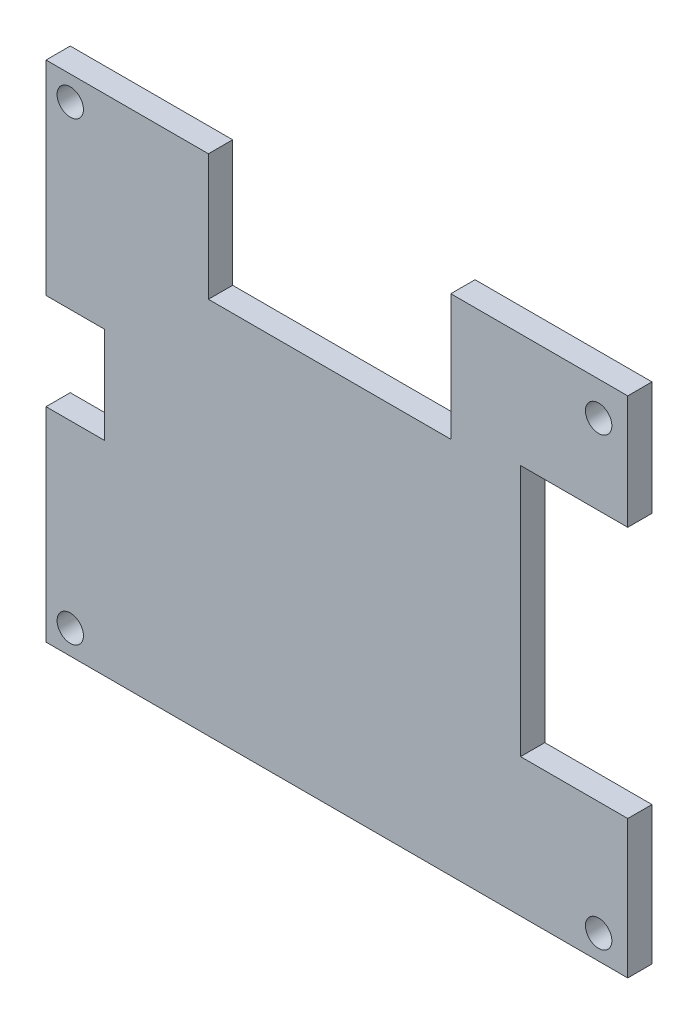
ISO-10303-21;
HEADER;
FILE_DESCRIPTION(('STEP AP214'),'2;1');
FILE_NAME('part.step','',(''),(''),'','','');
FILE_SCHEMA(('AUTOMOTIVE_DESIGN { 1 0 10303 214 1 1 1 1 }'));
ENDSEC;
DATA;
#1=APPLICATION_CONTEXT('core data for automotive mechanical design processes');
#2=APPLICATION_PROTOCOL_DEFINITION('international standard','automotive_design',2000,#1);
#3=PRODUCT_CONTEXT('',#1,'mechanical');
#4=PRODUCT('Part','Part','',(#3));
#5=PRODUCT_RELATED_PRODUCT_CATEGORY('part','',(#4));
#6=PRODUCT_DEFINITION_FORMATION('','',#4);
#7=PRODUCT_DEFINITION_CONTEXT('part definition',#1,'design');
#8=PRODUCT_DEFINITION('design','',#6,#7);
#9=PRODUCT_DEFINITION_SHAPE('','',#8);
#10=(LENGTH_UNIT() NAMED_UNIT(*) SI_UNIT(.MILLI.,.METRE.));
#11=(NAMED_UNIT(*) PLANE_ANGLE_UNIT() SI_UNIT($,.RADIAN.));
#12=(NAMED_UNIT(*) SI_UNIT($,.STERADIAN.) SOLID_ANGLE_UNIT());
#13=UNCERTAINTY_MEASURE_WITH_UNIT(LENGTH_MEASURE(1.E-05),#10,'distance_accuracy_value','');
#14=(GEOMETRIC_REPRESENTATION_CONTEXT(3) GLOBAL_UNCERTAINTY_ASSIGNED_CONTEXT((#13)) GLOBAL_UNIT_ASSIGNED_CONTEXT((#10,
#11,#12)) REPRESENTATION_CONTEXT('',''));
#15=CARTESIAN_POINT('',(0.,0.,0.));
#16=DIRECTION('',(0.,0.,1.));
#17=DIRECTION('',(1.,0.,0.));
#18=AXIS2_PLACEMENT_3D('',#15,#16,#17);
#19=CARTESIAN_POINT('',(0.,0.,3.175));
#20=DIRECTION('',(0.,0.,-1.));
#21=DIRECTION('',(-1.,0.,0.));
#22=AXIS2_PLACEMENT_3D('',#19,#20,#21);
#23=PLANE('',#22);
#24=CARTESIAN_POINT('',(-34.925,29.845,3.175));
#25=DIRECTION('',(0.,0.,1.));
#26=DIRECTION('',(1.,0.,0.));
#27=AXIS2_PLACEMENT_3D('',#24,#25,#26);
#28=CIRCLE('',#27,1.72719999999999);
#29=CARTESIAN_POINT('',(-33.1978,29.845,3.175));
#30=VERTEX_POINT('',#29);
#31=EDGE_CURVE('E340',#30,#30,#28,.T.);
#32=ORIENTED_EDGE('',*,*,#31,.F.);
#33=EDGE_LOOP('',(#32));
#34=FACE_BOUND('',#33,.T.);
#35=CARTESIAN_POINT('',(34.29,28.575,3.175));
#36=DIRECTION('',(0.,0.,1.));
#37=DIRECTION('',(1.,0.,0.));
#38=AXIS2_PLACEMENT_3D('',#35,#36,#37);
#39=CIRCLE('',#38,1.72719999999999);
#40=CARTESIAN_POINT('',(36.0172,28.575,3.175));
#41=VERTEX_POINT('',#40);
#42=EDGE_CURVE('E342',#41,#41,#39,.T.);
#43=ORIENTED_EDGE('',*,*,#42,.F.);
#44=EDGE_LOOP('',(#43));
#45=FACE_BOUND('',#44,.T.);
#46=CARTESIAN_POINT('',(-34.925,-29.845,3.175));
#47=DIRECTION('',(0.,0.,1.));
#48=DIRECTION('',(1.,0.,0.));
#49=AXIS2_PLACEMENT_3D('',#46,#47,#48);
#50=CIRCLE('',#49,1.72719999999999);
#51=CARTESIAN_POINT('',(-33.1978,-29.845,3.175));
#52=VERTEX_POINT('',#51);
#53=EDGE_CURVE('E350',#52,#52,#50,.T.);
#54=ORIENTED_EDGE('',*,*,#53,.F.);
#55=EDGE_LOOP('',(#54));
#56=FACE_BOUND('',#55,.T.);
#57=DIRECTION('',(0.,-1.,0.));
#58=VECTOR('',#57,1.);
#59=CARTESIAN_POINT('',(-38.1,6.30588710651543,3.175));
#60=LINE('',#59,#58);
#61=CARTESIAN_POINT('',(-38.1,33.02,3.175));
#62=VERTEX_POINT('',#61);
#63=CARTESIAN_POINT('',(-38.1,6.30588710651543,3.175));
#64=VERTEX_POINT('',#63);
#65=EDGE_CURVE('E209',#62,#64,#60,.T.);
#66=ORIENTED_EDGE('',*,*,#65,.T.);
#67=DIRECTION('',(1.,0.,0.));
#68=VECTOR('',#67,1.);
#69=CARTESIAN_POINT('',(-30.4454302682109,6.30588710651543,3.175));
#70=LINE('',#69,#68);
#71=CARTESIAN_POINT('',(-30.4454302682109,6.30588710651543,3.175));
#72=VERTEX_POINT('',#71);
#73=EDGE_CURVE('E118',#64,#72,#70,.T.);
#74=ORIENTED_EDGE('',*,*,#73,.T.);
#75=DIRECTION('',(0.,-1.,0.));
#76=VECTOR('',#75,1.);
#77=CARTESIAN_POINT('',(-30.4454302682109,-6.30588710651542,3.175));
#78=LINE('',#77,#76);
#79=CARTESIAN_POINT('',(-30.4454302682109,-6.30588710651542,3.175));
#80=VERTEX_POINT('',#79);
#81=EDGE_CURVE('E249',#72,#80,#78,.T.);
#82=ORIENTED_EDGE('',*,*,#81,.T.);
#83=DIRECTION('',(-1.,0.,0.));
#84=VECTOR('',#83,1.);
#85=CARTESIAN_POINT('',(-38.1,-6.30588710651542,3.175));
#86=LINE('',#85,#84);
#87=CARTESIAN_POINT('',(-38.1,-6.30588710651542,3.175));
#88=VERTEX_POINT('',#87);
#89=EDGE_CURVE('E267',#80,#88,#86,.T.);
#90=ORIENTED_EDGE('',*,*,#89,.T.);
#91=DIRECTION('',(0.,-1.,0.));
#92=VECTOR('',#91,1.);
#93=CARTESIAN_POINT('',(-38.1,-33.02,3.175));
#94=LINE('',#93,#92);
#95=CARTESIAN_POINT('',(-38.1,-33.02,3.175));
#96=VERTEX_POINT('',#95);
#97=EDGE_CURVE('E264',#88,#96,#94,.T.);
#98=ORIENTED_EDGE('',*,*,#97,.T.);
#99=DIRECTION('',(1.,0.,0.));
#100=VECTOR('',#99,1.);
#101=CARTESIAN_POINT('',(38.1,-33.02,3.175));
#102=LINE('',#101,#100);
#103=CARTESIAN_POINT('',(38.1,-33.02,3.175));
#104=VERTEX_POINT('',#103);
#105=EDGE_CURVE('E266',#96,#104,#102,.T.);
#106=ORIENTED_EDGE('',*,*,#105,.T.);
#107=DIRECTION('',(0.,1.,0.));
#108=VECTOR('',#107,1.);
#109=CARTESIAN_POINT('',(38.1,-14.9261523422005,3.175));
#110=LINE('',#109,#108);
#111=CARTESIAN_POINT('',(38.1,-14.9261523422005,3.175));
#112=VERTEX_POINT('',#111);
#113=EDGE_CURVE('E269',#104,#112,#110,.T.);
#114=ORIENTED_EDGE('',*,*,#113,.T.);
#115=DIRECTION('',(-1.,0.,0.));
#116=VECTOR('',#115,1.);
#117=CARTESIAN_POINT('',(24.060772257231,-14.9261523422005,3.175));
#118=LINE('',#117,#116);
#119=CARTESIAN_POINT('',(24.060772257231,-14.9261523422005,3.175));
#120=VERTEX_POINT('',#119);
#121=EDGE_CURVE('E275',#112,#120,#118,.T.);
#122=ORIENTED_EDGE('',*,*,#121,.T.);
#123=DIRECTION('',(0.,1.,0.));
#124=VECTOR('',#123,1.);
#125=CARTESIAN_POINT('',(24.060772257231,18.1011502004126,3.175));
#126=LINE('',#125,#124);
#127=CARTESIAN_POINT('',(24.060772257231,18.1011502004126,3.175));
#128=VERTEX_POINT('',#127);
#129=EDGE_CURVE('E277',#120,#128,#126,.T.);
#130=ORIENTED_EDGE('',*,*,#129,.T.);
#131=DIRECTION('',(1.,0.,0.));
#132=VECTOR('',#131,1.);
#133=CARTESIAN_POINT('',(38.1,18.1011502004126,3.175));
#134=LINE('',#133,#132);
#135=CARTESIAN_POINT('',(38.1,18.1011502004126,3.175));
#136=VERTEX_POINT('',#135);
#137=EDGE_CURVE('E279',#128,#136,#134,.T.);
#138=ORIENTED_EDGE('',*,*,#137,.T.);
#139=DIRECTION('',(0.,1.,0.));
#140=VECTOR('',#139,1.);
#141=CARTESIAN_POINT('',(38.1,33.02,3.175));
#142=LINE('',#141,#140);
#143=CARTESIAN_POINT('',(38.1,33.02,3.175));
#144=VERTEX_POINT('',#143);
#145=EDGE_CURVE('E281',#136,#144,#142,.T.);
#146=ORIENTED_EDGE('',*,*,#145,.T.);
#147=DIRECTION('',(-1.,0.,0.));
#148=VECTOR('',#147,1.);
#149=CARTESIAN_POINT('',(14.9225,33.02,3.175));
#150=LINE('',#149,#148);
#151=CARTESIAN_POINT('',(14.9225,33.02,3.175));
#152=VERTEX_POINT('',#151);
#153=EDGE_CURVE('E283',#144,#152,#150,.T.);
#154=ORIENTED_EDGE('',*,*,#153,.T.);
#155=DIRECTION('',(0.,-1.,0.));
#156=VECTOR('',#155,1.);
#157=CARTESIAN_POINT('',(14.9225,16.51,3.175));
#158=LINE('',#157,#156);
#159=CARTESIAN_POINT('',(14.9225,16.51,3.175));
#160=VERTEX_POINT('',#159);
#161=EDGE_CURVE('E161',#152,#160,#158,.T.);
#162=ORIENTED_EDGE('',*,*,#161,.T.);
#163=DIRECTION('',(-1.,0.,0.));
#164=VECTOR('',#163,1.);
#165=CARTESIAN_POINT('',(-16.8275,16.51,3.175));
#166=LINE('',#165,#164);
#167=CARTESIAN_POINT('',(-16.8275,16.51,3.175));
#168=VERTEX_POINT('',#167);
#169=EDGE_CURVE('E155',#160,#168,#166,.T.);
#170=ORIENTED_EDGE('',*,*,#169,.T.);
#171=DIRECTION('',(0.,1.,0.));
#172=VECTOR('',#171,1.);
#173=CARTESIAN_POINT('',(-16.8275,33.02,3.175));
#174=LINE('',#173,#172);
#175=CARTESIAN_POINT('',(-16.8275,33.02,3.175));
#176=VERTEX_POINT('',#175);
#177=EDGE_CURVE('E159',#168,#176,#174,.T.);
#178=ORIENTED_EDGE('',*,*,#177,.T.);
#179=DIRECTION('',(-1.,0.,0.));
#180=VECTOR('',#179,1.);
#181=CARTESIAN_POINT('',(-38.1,33.02,3.175));
#182=LINE('',#181,#180);
#183=EDGE_CURVE('E51',#176,#62,#182,.T.);
#184=ORIENTED_EDGE('',*,*,#183,.T.);
#185=EDGE_LOOP('',(#66,#74,#82,#90,#98,#106,#114,#122,#130,#138,#146,#154,#162,#170,#178,#184));
#186=FACE_BOUND('',#185,.T.);
#187=CARTESIAN_POINT('',(34.29,-29.845,3.175));
#188=DIRECTION('',(0.,0.,1.));
#189=DIRECTION('',(1.,0.,0.));
#190=AXIS2_PLACEMENT_3D('',#187,#188,#189);
#191=CIRCLE('',#190,1.72719999999999);
#192=CARTESIAN_POINT('',(36.0172,-29.845,3.175));
#193=VERTEX_POINT('',#192);
#194=EDGE_CURVE('E356',#193,#193,#191,.T.);
#195=ORIENTED_EDGE('',*,*,#194,.F.);
#196=EDGE_LOOP('',(#195));
#197=FACE_BOUND('',#196,.T.);
#198=ADVANCED_FACE('F33',(#34,#45,#56,#186,#197),#23,.F.);
#199=CARTESIAN_POINT('',(-38.1,6.30588710651543,3.175));
#200=DIRECTION('',(1.,0.,0.));
#201=DIRECTION('',(0.,0.,-1.));
#202=AXIS2_PLACEMENT_3D('',#199,#200,#201);
#203=PLANE('',#202);
#204=DIRECTION('',(0.,-1.,0.));
#205=VECTOR('',#204,1.);
#206=CARTESIAN_POINT('',(-38.1,6.30588710651543,0.));
#207=LINE('',#206,#205);
#208=CARTESIAN_POINT('',(-38.1,33.02,0.));
#209=VERTEX_POINT('',#208);
#210=CARTESIAN_POINT('',(-38.1,6.30588710651543,0.));
#211=VERTEX_POINT('',#210);
#212=EDGE_CURVE('E179',#209,#211,#207,.T.);
#213=ORIENTED_EDGE('',*,*,#212,.T.);
#214=DIRECTION('',(0.,0.,-1.));
#215=VECTOR('',#214,1.);
#216=CARTESIAN_POINT('',(-38.1,6.30588710651543,3.175));
#217=LINE('',#216,#215);
#218=EDGE_CURVE('E11',#64,#211,#217,.T.);
#219=ORIENTED_EDGE('',*,*,#218,.F.);
#220=ORIENTED_EDGE('',*,*,#65,.F.);
#221=DIRECTION('',(0.,0.,-1.));
#222=VECTOR('',#221,1.);
#223=CARTESIAN_POINT('',(-38.1,33.02,3.175));
#224=LINE('',#223,#222);
#225=EDGE_CURVE('E175',#62,#209,#224,.T.);
#226=ORIENTED_EDGE('',*,*,#225,.T.);
#227=EDGE_LOOP('',(#213,#219,#220,#226));
#228=FACE_BOUND('',#227,.T.);
#229=ADVANCED_FACE('F35',(#228),#203,.F.);
#230=CARTESIAN_POINT('',(-30.4454302682109,6.30588710651543,3.175));
#231=DIRECTION('',(0.,1.,0.));
#232=DIRECTION('',(-1.,0.,0.));
#233=AXIS2_PLACEMENT_3D('',#230,#231,#232);
#234=PLANE('',#233);
#235=DIRECTION('',(1.,0.,0.));
#236=VECTOR('',#235,1.);
#237=CARTESIAN_POINT('',(-30.4454302682109,6.30588710651543,0.));
#238=LINE('',#237,#236);
#239=CARTESIAN_POINT('',(-30.4454302682109,6.30588710651543,0.));
#240=VERTEX_POINT('',#239);
#241=EDGE_CURVE('E182',#211,#240,#238,.T.);
#242=ORIENTED_EDGE('',*,*,#241,.T.);
#243=DIRECTION('',(0.,0.,-1.));
#244=VECTOR('',#243,1.);
#245=CARTESIAN_POINT('',(-30.4454302682109,6.30588710651543,3.175));
#246=LINE('',#245,#244);
#247=EDGE_CURVE('E43',#72,#240,#246,.T.);
#248=ORIENTED_EDGE('',*,*,#247,.F.);
#249=ORIENTED_EDGE('',*,*,#73,.F.);
#250=ORIENTED_EDGE('',*,*,#218,.T.);
#251=EDGE_LOOP('',(#242,#248,#249,#250));
#252=FACE_BOUND('',#251,.T.);
#253=ADVANCED_FACE('F315',(#252),#234,.F.);
#254=CARTESIAN_POINT('',(-30.4454302682109,-6.30588710651542,3.175));
#255=DIRECTION('',(1.,0.,0.));
#256=DIRECTION('',(0.,0.,-1.));
#257=AXIS2_PLACEMENT_3D('',#254,#255,#256);
#258=PLANE('',#257);
#259=DIRECTION('',(0.,-1.,0.));
#260=VECTOR('',#259,1.);
#261=CARTESIAN_POINT('',(-30.4454302682109,-6.30588710651542,0.));
#262=LINE('',#261,#260);
#263=CARTESIAN_POINT('',(-30.4454302682109,-6.30588710651542,0.));
#264=VERTEX_POINT('',#263);
#265=EDGE_CURVE('E184',#240,#264,#262,.T.);
#266=ORIENTED_EDGE('',*,*,#265,.T.);
#267=DIRECTION('',(0.,0.,-1.));
#268=VECTOR('',#267,1.);
#269=CARTESIAN_POINT('',(-30.4454302682109,-6.30588710651542,3.175));
#270=LINE('',#269,#268);
#271=EDGE_CURVE('E240',#80,#264,#270,.T.);
#272=ORIENTED_EDGE('',*,*,#271,.F.);
#273=ORIENTED_EDGE('',*,*,#81,.F.);
#274=ORIENTED_EDGE('',*,*,#247,.T.);
#275=EDGE_LOOP('',(#266,#272,#273,#274));
#276=FACE_BOUND('',#275,.T.);
#277=ADVANCED_FACE('F247',(#276),#258,.F.);
#278=CARTESIAN_POINT('',(-38.1,-6.30588710651542,3.175));
#279=DIRECTION('',(0.,-1.,0.));
#280=DIRECTION('',(1.,0.,0.));
#281=AXIS2_PLACEMENT_3D('',#278,#279,#280);
#282=PLANE('',#281);
#283=DIRECTION('',(-1.,0.,0.));
#284=VECTOR('',#283,1.);
#285=CARTESIAN_POINT('',(-38.1,-6.30588710651542,0.));
#286=LINE('',#285,#284);
#287=CARTESIAN_POINT('',(-38.1,-6.30588710651542,0.));
#288=VERTEX_POINT('',#287);
#289=EDGE_CURVE('E186',#264,#288,#286,.T.);
#290=ORIENTED_EDGE('',*,*,#289,.T.);
#291=DIRECTION('',(0.,0.,-1.));
#292=VECTOR('',#291,1.);
#293=CARTESIAN_POINT('',(-38.1,-6.30588710651542,3.175));
#294=LINE('',#293,#292);
#295=EDGE_CURVE('E237',#88,#288,#294,.T.);
#296=ORIENTED_EDGE('',*,*,#295,.F.);
#297=ORIENTED_EDGE('',*,*,#89,.F.);
#298=ORIENTED_EDGE('',*,*,#271,.T.);
#299=EDGE_LOOP('',(#290,#296,#297,#298));
#300=FACE_BOUND('',#299,.T.);
#301=ADVANCED_FACE('F258',(#300),#282,.F.);
#302=CARTESIAN_POINT('',(-38.1,-33.02,3.175));
#303=DIRECTION('',(1.,0.,0.));
#304=DIRECTION('',(0.,0.,-1.));
#305=AXIS2_PLACEMENT_3D('',#302,#303,#304);
#306=PLANE('',#305);
#307=DIRECTION('',(0.,-1.,0.));
#308=VECTOR('',#307,1.);
#309=CARTESIAN_POINT('',(-38.1,-33.02,0.));
#310=LINE('',#309,#308);
#311=CARTESIAN_POINT('',(-38.1,-33.02,0.));
#312=VERTEX_POINT('',#311);
#313=EDGE_CURVE('E188',#288,#312,#310,.T.);
#314=ORIENTED_EDGE('',*,*,#313,.T.);
#315=DIRECTION('',(0.,0.,-1.));
#316=VECTOR('',#315,1.);
#317=CARTESIAN_POINT('',(-38.1,-33.02,3.175));
#318=LINE('',#317,#316);
#319=EDGE_CURVE('E234',#96,#312,#318,.T.);
#320=ORIENTED_EDGE('',*,*,#319,.F.);
#321=ORIENTED_EDGE('',*,*,#97,.F.);
#322=ORIENTED_EDGE('',*,*,#295,.T.);
#323=EDGE_LOOP('',(#314,#320,#321,#322));
#324=FACE_BOUND('',#323,.T.);
#325=ADVANCED_FACE('F262',(#324),#306,.F.);
#326=CARTESIAN_POINT('',(38.1,-33.02,3.175));
#327=DIRECTION('',(0.,1.,0.));
#328=DIRECTION('',(0.,0.,1.));
#329=AXIS2_PLACEMENT_3D('',#326,#327,#328);
#330=PLANE('',#329);
#331=DIRECTION('',(1.,0.,0.));
#332=VECTOR('',#331,1.);
#333=CARTESIAN_POINT('',(38.1,-33.02,0.));
#334=LINE('',#333,#332);
#335=CARTESIAN_POINT('',(38.1,-33.02,0.));
#336=VERTEX_POINT('',#335);
#337=EDGE_CURVE('E190',#312,#336,#334,.T.);
#338=ORIENTED_EDGE('',*,*,#337,.T.);
#339=DIRECTION('',(0.,0.,-1.));
#340=VECTOR('',#339,1.);
#341=CARTESIAN_POINT('',(38.1,-33.02,3.175));
#342=LINE('',#341,#340);
#343=EDGE_CURVE('E231',#104,#336,#342,.T.);
#344=ORIENTED_EDGE('',*,*,#343,.F.);
#345=ORIENTED_EDGE('',*,*,#105,.F.);
#346=ORIENTED_EDGE('',*,*,#319,.T.);
#347=EDGE_LOOP('',(#338,#344,#345,#346));
#348=FACE_BOUND('',#347,.T.);
#349=ADVANCED_FACE('F470',(#348),#330,.F.);
#350=CARTESIAN_POINT('',(38.1,-14.9261523422005,3.175));
#351=DIRECTION('',(-1.,0.,0.));
#352=DIRECTION('',(0.,-1.,0.));
#353=AXIS2_PLACEMENT_3D('',#350,#351,#352);
#354=PLANE('',#353);
#355=DIRECTION('',(0.,1.,0.));
#356=VECTOR('',#355,1.);
#357=CARTESIAN_POINT('',(38.1,-14.9261523422005,0.));
#358=LINE('',#357,#356);
#359=CARTESIAN_POINT('',(38.1,-14.9261523422005,0.));
#360=VERTEX_POINT('',#359);
#361=EDGE_CURVE('E192',#336,#360,#358,.T.);
#362=ORIENTED_EDGE('',*,*,#361,.T.);
#363=DIRECTION('',(0.,0.,-1.));
#364=VECTOR('',#363,1.);
#365=CARTESIAN_POINT('',(38.1,-14.9261523422005,3.175));
#366=LINE('',#365,#364);
#367=EDGE_CURVE('E228',#112,#360,#366,.T.);
#368=ORIENTED_EDGE('',*,*,#367,.F.);
#369=ORIENTED_EDGE('',*,*,#113,.F.);
#370=ORIENTED_EDGE('',*,*,#343,.T.);
#371=EDGE_LOOP('',(#362,#368,#369,#370));
#372=FACE_BOUND('',#371,.T.);
#373=ADVANCED_FACE('F461',(#372),#354,.F.);
#374=CARTESIAN_POINT('',(24.060772257231,-14.9261523422005,3.175));
#375=DIRECTION('',(0.,-1.,0.));
#376=DIRECTION('',(1.,0.,0.));
#377=AXIS2_PLACEMENT_3D('',#374,#375,#376);
#378=PLANE('',#377);
#379=DIRECTION('',(-1.,0.,0.));
#380=VECTOR('',#379,1.);
#381=CARTESIAN_POINT('',(24.060772257231,-14.9261523422005,0.));
#382=LINE('',#381,#380);
#383=CARTESIAN_POINT('',(24.060772257231,-14.9261523422005,0.));
#384=VERTEX_POINT('',#383);
#385=EDGE_CURVE('E194',#360,#384,#382,.T.);
#386=ORIENTED_EDGE('',*,*,#385,.T.);
#387=DIRECTION('',(0.,0.,-1.));
#388=VECTOR('',#387,1.);
#389=CARTESIAN_POINT('',(24.060772257231,-14.9261523422005,3.175));
#390=LINE('',#389,#388);
#391=EDGE_CURVE('E225',#120,#384,#390,.T.);
#392=ORIENTED_EDGE('',*,*,#391,.F.);
#393=ORIENTED_EDGE('',*,*,#121,.F.);
#394=ORIENTED_EDGE('',*,*,#367,.T.);
#395=EDGE_LOOP('',(#386,#392,#393,#394));
#396=FACE_BOUND('',#395,.T.);
#397=ADVANCED_FACE('F452',(#396),#378,.F.);
#398=CARTESIAN_POINT('',(24.060772257231,18.1011502004126,3.175));
#399=DIRECTION('',(-1.,0.,0.));
#400=DIRECTION('',(0.,-1.,0.));
#401=AXIS2_PLACEMENT_3D('',#398,#399,#400);
#402=PLANE('',#401);
#403=DIRECTION('',(0.,1.,0.));
#404=VECTOR('',#403,1.);
#405=CARTESIAN_POINT('',(24.060772257231,18.1011502004126,0.));
#406=LINE('',#405,#404);
#407=CARTESIAN_POINT('',(24.060772257231,18.1011502004126,0.));
#408=VERTEX_POINT('',#407);
#409=EDGE_CURVE('E196',#384,#408,#406,.T.);
#410=ORIENTED_EDGE('',*,*,#409,.T.);
#411=DIRECTION('',(0.,0.,-1.));
#412=VECTOR('',#411,1.);
#413=CARTESIAN_POINT('',(24.060772257231,18.1011502004126,3.175));
#414=LINE('',#413,#412);
#415=EDGE_CURVE('E222',#128,#408,#414,.T.);
#416=ORIENTED_EDGE('',*,*,#415,.F.);
#417=ORIENTED_EDGE('',*,*,#129,.F.);
#418=ORIENTED_EDGE('',*,*,#391,.T.);
#419=EDGE_LOOP('',(#410,#416,#417,#418));
#420=FACE_BOUND('',#419,.T.);
#421=ADVANCED_FACE('F443',(#420),#402,.F.);
#422=CARTESIAN_POINT('',(38.1,18.1011502004126,3.175));
#423=DIRECTION('',(0.,1.,0.));
#424=DIRECTION('',(0.,0.,1.));
#425=AXIS2_PLACEMENT_3D('',#422,#423,#424);
#426=PLANE('',#425);
#427=DIRECTION('',(1.,0.,0.));
#428=VECTOR('',#427,1.);
#429=CARTESIAN_POINT('',(38.1,18.1011502004126,0.));
#430=LINE('',#429,#428);
#431=CARTESIAN_POINT('',(38.1,18.1011502004126,0.));
#432=VERTEX_POINT('',#431);
#433=EDGE_CURVE('E198',#408,#432,#430,.T.);
#434=ORIENTED_EDGE('',*,*,#433,.T.);
#435=DIRECTION('',(0.,0.,-1.));
#436=VECTOR('',#435,1.);
#437=CARTESIAN_POINT('',(38.1,18.1011502004126,3.175));
#438=LINE('',#437,#436);
#439=EDGE_CURVE('E219',#136,#432,#438,.T.);
#440=ORIENTED_EDGE('',*,*,#439,.F.);
#441=ORIENTED_EDGE('',*,*,#137,.F.);
#442=ORIENTED_EDGE('',*,*,#415,.T.);
#443=EDGE_LOOP('',(#434,#440,#441,#442));
#444=FACE_BOUND('',#443,.T.);
#445=ADVANCED_FACE('F434',(#444),#426,.F.);
#446=CARTESIAN_POINT('',(38.1,33.02,3.175));
#447=DIRECTION('',(-1.,0.,0.));
#448=DIRECTION('',(0.,0.,1.));
#449=AXIS2_PLACEMENT_3D('',#446,#447,#448);
#450=PLANE('',#449);
#451=DIRECTION('',(0.,1.,0.));
#452=VECTOR('',#451,1.);
#453=CARTESIAN_POINT('',(38.1,33.02,0.));
#454=LINE('',#453,#452);
#455=CARTESIAN_POINT('',(38.1,33.02,0.));
#456=VERTEX_POINT('',#455);
#457=EDGE_CURVE('E200',#432,#456,#454,.T.);
#458=ORIENTED_EDGE('',*,*,#457,.T.);
#459=DIRECTION('',(0.,0.,-1.));
#460=VECTOR('',#459,1.);
#461=CARTESIAN_POINT('',(38.1,33.02,3.175));
#462=LINE('',#461,#460);
#463=EDGE_CURVE('E216',#144,#456,#462,.T.);
#464=ORIENTED_EDGE('',*,*,#463,.F.);
#465=ORIENTED_EDGE('',*,*,#145,.F.);
#466=ORIENTED_EDGE('',*,*,#439,.T.);
#467=EDGE_LOOP('',(#458,#464,#465,#466));
#468=FACE_BOUND('',#467,.T.);
#469=ADVANCED_FACE('F426',(#468),#450,.F.);
#470=CARTESIAN_POINT('',(14.9225,33.02,3.175));
#471=DIRECTION('',(0.,-1.,0.));
#472=DIRECTION('',(0.,0.,-1.));
#473=AXIS2_PLACEMENT_3D('',#470,#471,#472);
#474=PLANE('',#473);
#475=DIRECTION('',(-1.,0.,0.));
#476=VECTOR('',#475,1.);
#477=CARTESIAN_POINT('',(14.9225,33.02,0.));
#478=LINE('',#477,#476);
#479=CARTESIAN_POINT('',(14.9225,33.02,0.));
#480=VERTEX_POINT('',#479);
#481=EDGE_CURVE('E202',#456,#480,#478,.T.);
#482=ORIENTED_EDGE('',*,*,#481,.T.);
#483=DIRECTION('',(0.,0.,-1.));
#484=VECTOR('',#483,1.);
#485=CARTESIAN_POINT('',(14.9225,33.02,3.175));
#486=LINE('',#485,#484);
#487=EDGE_CURVE('E213',#152,#480,#486,.T.);
#488=ORIENTED_EDGE('',*,*,#487,.F.);
#489=ORIENTED_EDGE('',*,*,#153,.F.);
#490=ORIENTED_EDGE('',*,*,#463,.T.);
#491=EDGE_LOOP('',(#482,#488,#489,#490));
#492=FACE_BOUND('',#491,.T.);
#493=ADVANCED_FACE('F289',(#492),#474,.F.);
#494=CARTESIAN_POINT('',(14.9225,16.51,3.175));
#495=DIRECTION('',(1.,0.,0.));
#496=DIRECTION('',(0.,0.,-1.));
#497=AXIS2_PLACEMENT_3D('',#494,#495,#496);
#498=PLANE('',#497);
#499=DIRECTION('',(0.,-1.,0.));
#500=VECTOR('',#499,1.);
#501=CARTESIAN_POINT('',(14.9225,16.51,0.));
#502=LINE('',#501,#500);
#503=CARTESIAN_POINT('',(14.9225,16.51,0.));
#504=VERTEX_POINT('',#503);
#505=EDGE_CURVE('E204',#480,#504,#502,.T.);
#506=ORIENTED_EDGE('',*,*,#505,.T.);
#507=DIRECTION('',(0.,0.,-1.));
#508=VECTOR('',#507,1.);
#509=CARTESIAN_POINT('',(14.9225,16.51,3.175));
#510=LINE('',#509,#508);
#511=EDGE_CURVE('E170',#160,#504,#510,.T.);
#512=ORIENTED_EDGE('',*,*,#511,.F.);
#513=ORIENTED_EDGE('',*,*,#161,.F.);
#514=ORIENTED_EDGE('',*,*,#487,.T.);
#515=EDGE_LOOP('',(#506,#512,#513,#514));
#516=FACE_BOUND('',#515,.T.);
#517=ADVANCED_FACE('F293',(#516),#498,.F.);
#518=CARTESIAN_POINT('',(-16.8275,16.51,3.175));
#519=DIRECTION('',(0.,-1.,0.));
#520=DIRECTION('',(0.,0.,-1.));
#521=AXIS2_PLACEMENT_3D('',#518,#519,#520);
#522=PLANE('',#521);
#523=DIRECTION('',(-1.,0.,0.));
#524=VECTOR('',#523,1.);
#525=CARTESIAN_POINT('',(-16.8275,16.51,0.));
#526=LINE('',#525,#524);
#527=CARTESIAN_POINT('',(-16.8275,16.51,0.));
#528=VERTEX_POINT('',#527);
#529=EDGE_CURVE('E169',#504,#528,#526,.T.);
#530=ORIENTED_EDGE('',*,*,#529,.T.);
#531=DIRECTION('',(0.,0.,-1.));
#532=VECTOR('',#531,1.);
#533=CARTESIAN_POINT('',(-16.8275,16.51,3.175));
#534=LINE('',#533,#532);
#535=EDGE_CURVE('E166',#168,#528,#534,.T.);
#536=ORIENTED_EDGE('',*,*,#535,.F.);
#537=ORIENTED_EDGE('',*,*,#169,.F.);
#538=ORIENTED_EDGE('',*,*,#511,.T.);
#539=EDGE_LOOP('',(#530,#536,#537,#538));
#540=FACE_BOUND('',#539,.T.);
#541=ADVANCED_FACE('F167',(#540),#522,.F.);
#542=CARTESIAN_POINT('',(-16.8275,33.02,3.175));
#543=DIRECTION('',(-1.,0.,0.));
#544=DIRECTION('',(0.,-1.,0.));
#545=AXIS2_PLACEMENT_3D('',#542,#543,#544);
#546=PLANE('',#545);
#547=DIRECTION('',(0.,1.,0.));
#548=VECTOR('',#547,1.);
#549=CARTESIAN_POINT('',(-16.8275,33.02,0.));
#550=LINE('',#549,#548);
#551=CARTESIAN_POINT('',(-16.8275,33.02,0.));
#552=VERTEX_POINT('',#551);
#553=EDGE_CURVE('E104',#528,#552,#550,.T.);
#554=ORIENTED_EDGE('',*,*,#553,.T.);
#555=DIRECTION('',(0.,0.,-1.));
#556=VECTOR('',#555,1.);
#557=CARTESIAN_POINT('',(-16.8275,33.02,3.175));
#558=LINE('',#557,#556);
#559=EDGE_CURVE('E171',#176,#552,#558,.T.);
#560=ORIENTED_EDGE('',*,*,#559,.F.);
#561=ORIENTED_EDGE('',*,*,#177,.F.);
#562=ORIENTED_EDGE('',*,*,#535,.T.);
#563=EDGE_LOOP('',(#554,#560,#561,#562));
#564=FACE_BOUND('',#563,.T.);
#565=ADVANCED_FACE('F173',(#564),#546,.F.);
#566=CARTESIAN_POINT('',(-38.1,33.02,3.175));
#567=DIRECTION('',(0.,-1.,0.));
#568=DIRECTION('',(0.,0.,-1.));
#569=AXIS2_PLACEMENT_3D('',#566,#567,#568);
#570=PLANE('',#569);
#571=DIRECTION('',(-1.,0.,0.));
#572=VECTOR('',#571,1.);
#573=CARTESIAN_POINT('',(-38.1,33.02,0.));
#574=LINE('',#573,#572);
#575=EDGE_CURVE('E110',#552,#209,#574,.T.);
#576=ORIENTED_EDGE('',*,*,#575,.T.);
#577=ORIENTED_EDGE('',*,*,#225,.F.);
#578=ORIENTED_EDGE('',*,*,#183,.F.);
#579=ORIENTED_EDGE('',*,*,#559,.T.);
#580=EDGE_LOOP('',(#576,#577,#578,#579));
#581=FACE_BOUND('',#580,.T.);
#582=ADVANCED_FACE('F297',(#581),#570,.F.);
#583=CARTESIAN_POINT('',(0.,0.,0.));
#584=DIRECTION('',(0.,0.,-1.));
#585=DIRECTION('',(-1.,0.,0.));
#586=AXIS2_PLACEMENT_3D('',#583,#584,#585);
#587=PLANE('',#586);
#588=CARTESIAN_POINT('',(-34.925,29.845,0.));
#589=DIRECTION('',(0.,0.,-1.));
#590=DIRECTION('',(-1.,0.,0.));
#591=AXIS2_PLACEMENT_3D('',#588,#589,#590);
#592=CIRCLE('',#591,1.72719999999999);
#593=CARTESIAN_POINT('',(-36.6522,29.845,0.));
#594=VERTEX_POINT('',#593);
#595=EDGE_CURVE('E338',#594,#594,#592,.T.);
#596=ORIENTED_EDGE('',*,*,#595,.F.);
#597=EDGE_LOOP('',(#596));
#598=FACE_BOUND('',#597,.T.);
#599=CARTESIAN_POINT('',(34.29,28.575,0.));
#600=DIRECTION('',(0.,0.,-1.));
#601=DIRECTION('',(-1.,0.,0.));
#602=AXIS2_PLACEMENT_3D('',#599,#600,#601);
#603=CIRCLE('',#602,1.72719999999999);
#604=CARTESIAN_POINT('',(32.5628,28.575,0.));
#605=VERTEX_POINT('',#604);
#606=EDGE_CURVE('E347',#605,#605,#603,.T.);
#607=ORIENTED_EDGE('',*,*,#606,.F.);
#608=EDGE_LOOP('',(#607));
#609=FACE_BOUND('',#608,.T.);
#610=CARTESIAN_POINT('',(-34.925,-29.845,0.));
#611=DIRECTION('',(0.,0.,-1.));
#612=DIRECTION('',(-1.,0.,0.));
#613=AXIS2_PLACEMENT_3D('',#610,#611,#612);
#614=CIRCLE('',#613,1.72719999999999);
#615=CARTESIAN_POINT('',(-36.6522,-29.845,0.));
#616=VERTEX_POINT('',#615);
#617=EDGE_CURVE('E353',#616,#616,#614,.T.);
#618=ORIENTED_EDGE('',*,*,#617,.F.);
#619=EDGE_LOOP('',(#618));
#620=FACE_BOUND('',#619,.T.);
#621=CARTESIAN_POINT('',(34.29,-29.845,0.));
#622=DIRECTION('',(0.,0.,-1.));
#623=DIRECTION('',(-1.,0.,0.));
#624=AXIS2_PLACEMENT_3D('',#621,#622,#623);
#625=CIRCLE('',#624,1.72719999999999);
#626=CARTESIAN_POINT('',(32.5628,-29.845,0.));
#627=VERTEX_POINT('',#626);
#628=EDGE_CURVE('E37',#627,#627,#625,.T.);
#629=ORIENTED_EDGE('',*,*,#628,.F.);
#630=EDGE_LOOP('',(#629));
#631=FACE_BOUND('',#630,.T.);
#632=ORIENTED_EDGE('',*,*,#212,.F.);
#633=ORIENTED_EDGE('',*,*,#575,.F.);
#634=ORIENTED_EDGE('',*,*,#553,.F.);
#635=ORIENTED_EDGE('',*,*,#529,.F.);
#636=ORIENTED_EDGE('',*,*,#505,.F.);
#637=ORIENTED_EDGE('',*,*,#481,.F.);
#638=ORIENTED_EDGE('',*,*,#457,.F.);
#639=ORIENTED_EDGE('',*,*,#433,.F.);
#640=ORIENTED_EDGE('',*,*,#409,.F.);
#641=ORIENTED_EDGE('',*,*,#385,.F.);
#642=ORIENTED_EDGE('',*,*,#361,.F.);
#643=ORIENTED_EDGE('',*,*,#337,.F.);
#644=ORIENTED_EDGE('',*,*,#313,.F.);
#645=ORIENTED_EDGE('',*,*,#289,.F.);
#646=ORIENTED_EDGE('',*,*,#265,.F.);
#647=ORIENTED_EDGE('',*,*,#241,.F.);
#648=EDGE_LOOP('',(#632,#633,#634,#635,#636,#637,#638,#639,#640,#641,#642,#643,#644,#645,#646,#647));
#649=FACE_BOUND('',#648,.T.);
#650=ADVANCED_FACE('F253',(#598,#609,#620,#631,#649),#587,.T.);
#651=CARTESIAN_POINT('',(34.29,-29.845,3.175));
#652=DIRECTION('',(0.,0.,1.));
#653=DIRECTION('',(1.,0.,0.));
#654=AXIS2_PLACEMENT_3D('',#651,#652,#653);
#655=CYLINDRICAL_SURFACE('',#654,1.72719999999999);
#656=ORIENTED_EDGE('',*,*,#628,.T.);
#657=EDGE_LOOP('',(#656));
#658=FACE_BOUND('',#657,.T.);
#659=ORIENTED_EDGE('',*,*,#194,.T.);
#660=EDGE_LOOP('',(#659));
#661=FACE_BOUND('',#660,.T.);
#662=ADVANCED_FACE('F305',(#658,#661),#655,.F.);
#663=CARTESIAN_POINT('',(-34.925,-29.845,3.175));
#664=DIRECTION('',(0.,0.,1.));
#665=DIRECTION('',(1.,0.,0.));
#666=AXIS2_PLACEMENT_3D('',#663,#664,#665);
#667=CYLINDRICAL_SURFACE('',#666,1.72719999999999);
#668=ORIENTED_EDGE('',*,*,#617,.T.);
#669=EDGE_LOOP('',(#668));
#670=FACE_BOUND('',#669,.T.);
#671=ORIENTED_EDGE('',*,*,#53,.T.);
#672=EDGE_LOOP('',(#671));
#673=FACE_BOUND('',#672,.T.);
#674=ADVANCED_FACE('F321',(#670,#673),#667,.F.);
#675=CARTESIAN_POINT('',(34.29,28.575,3.175));
#676=DIRECTION('',(0.,0.,1.));
#677=DIRECTION('',(1.,0.,0.));
#678=AXIS2_PLACEMENT_3D('',#675,#676,#677);
#679=CYLINDRICAL_SURFACE('',#678,1.72719999999999);
#680=ORIENTED_EDGE('',*,*,#606,.T.);
#681=EDGE_LOOP('',(#680));
#682=FACE_BOUND('',#681,.T.);
#683=ORIENTED_EDGE('',*,*,#42,.T.);
#684=EDGE_LOOP('',(#683));
#685=FACE_BOUND('',#684,.T.);
#686=ADVANCED_FACE('F325',(#682,#685),#679,.F.);
#687=CARTESIAN_POINT('',(-34.925,29.845,3.175));
#688=DIRECTION('',(0.,0.,1.));
#689=DIRECTION('',(1.,0.,0.));
#690=AXIS2_PLACEMENT_3D('',#687,#688,#689);
#691=CYLINDRICAL_SURFACE('',#690,1.72719999999999);
#692=ORIENTED_EDGE('',*,*,#595,.T.);
#693=EDGE_LOOP('',(#692));
#694=FACE_BOUND('',#693,.T.);
#695=ORIENTED_EDGE('',*,*,#31,.T.);
#696=EDGE_LOOP('',(#695));
#697=FACE_BOUND('',#696,.T.);
#698=ADVANCED_FACE('F329',(#694,#697),#691,.F.);
#699=CLOSED_SHELL('',(#198,#229,#253,#277,#301,#325,#349,#373,#397,#421,#445,#469,#493,#517,
#541,#565,#582,#650,#662,#674,#686,#698));
#700=MANIFOLD_SOLID_BREP('B2',#699);
#701=ADVANCED_BREP_SHAPE_REPRESENTATION('',(#18,#700),#14);
#702=SHAPE_DEFINITION_REPRESENTATION(#9,#701);
ENDSEC;
END-ISO-10303-21;
